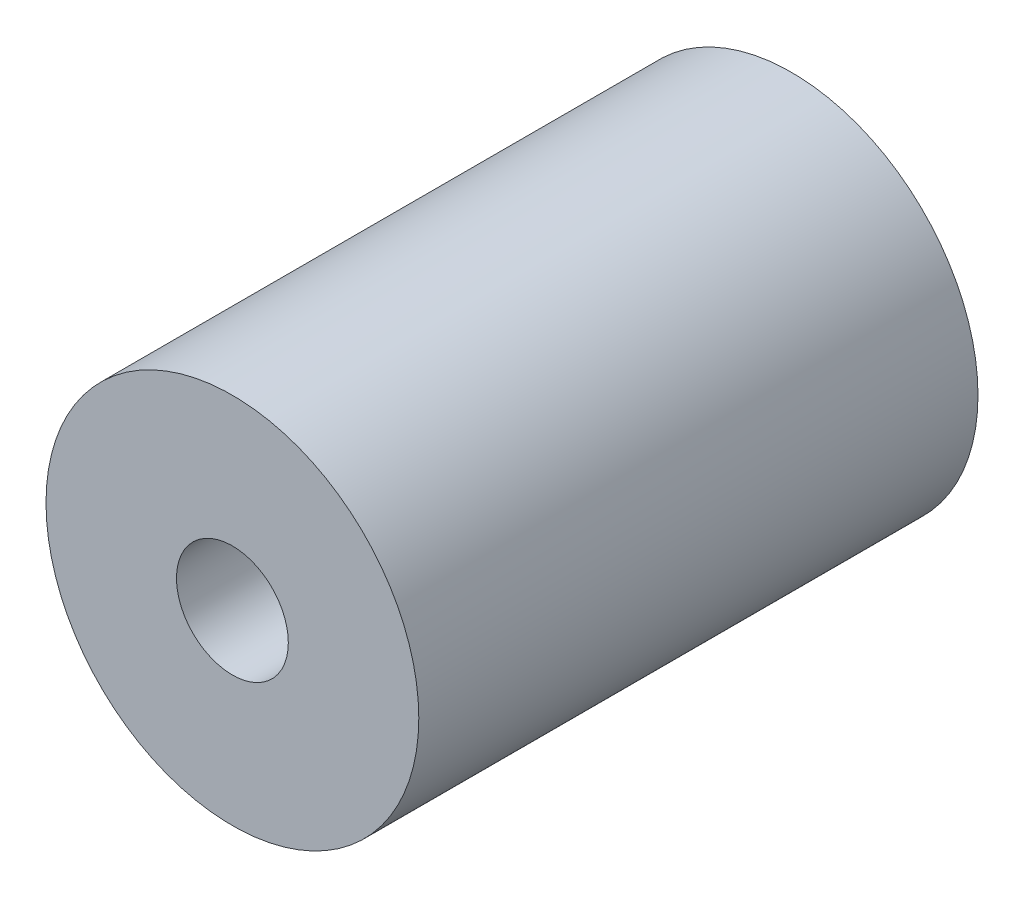
ISO-10303-21;
HEADER;
FILE_DESCRIPTION(('STEP AP214'),'2;1');
FILE_NAME('part.step','',(''),(''),'','','');
FILE_SCHEMA(('AUTOMOTIVE_DESIGN { 1 0 10303 214 1 1 1 1 }'));
ENDSEC;
DATA;
#1=APPLICATION_CONTEXT('core data for automotive mechanical design processes');
#2=APPLICATION_PROTOCOL_DEFINITION('international standard','automotive_design',2000,#1);
#3=PRODUCT_CONTEXT('',#1,'mechanical');
#4=PRODUCT('Part','Part','',(#3));
#5=PRODUCT_RELATED_PRODUCT_CATEGORY('part','',(#4));
#6=PRODUCT_DEFINITION_FORMATION('','',#4);
#7=PRODUCT_DEFINITION_CONTEXT('part definition',#1,'design');
#8=PRODUCT_DEFINITION('design','',#6,#7);
#9=PRODUCT_DEFINITION_SHAPE('','',#8);
#10=(LENGTH_UNIT() NAMED_UNIT(*) SI_UNIT(.MILLI.,.METRE.));
#11=(NAMED_UNIT(*) PLANE_ANGLE_UNIT() SI_UNIT($,.RADIAN.));
#12=(NAMED_UNIT(*) SI_UNIT($,.STERADIAN.) SOLID_ANGLE_UNIT());
#13=UNCERTAINTY_MEASURE_WITH_UNIT(LENGTH_MEASURE(1.E-05),#10,'distance_accuracy_value','');
#14=(GEOMETRIC_REPRESENTATION_CONTEXT(3) GLOBAL_UNCERTAINTY_ASSIGNED_CONTEXT((#13)) GLOBAL_UNIT_ASSIGNED_CONTEXT((#10,
#11,#12)) REPRESENTATION_CONTEXT('',''));
#15=CARTESIAN_POINT('',(0.,0.,0.));
#16=DIRECTION('',(0.,0.,1.));
#17=DIRECTION('',(1.,0.,0.));
#18=AXIS2_PLACEMENT_3D('',#15,#16,#17);
#19=CARTESIAN_POINT('',(0.,0.,15.));
#20=DIRECTION('',(0.,0.,-1.));
#21=DIRECTION('',(-1.,0.,0.));
#22=AXIS2_PLACEMENT_3D('',#19,#20,#21);
#23=CYLINDRICAL_SURFACE('',#22,5.);
#24=CARTESIAN_POINT('',(0.,0.,15.));
#25=DIRECTION('',(0.,0.,1.));
#26=DIRECTION('',(1.,0.,0.));
#27=AXIS2_PLACEMENT_3D('',#24,#25,#26);
#28=CIRCLE('',#27,5.);
#29=CARTESIAN_POINT('',(5.,0.,15.));
#30=VERTEX_POINT('',#29);
#31=EDGE_CURVE('E10',#30,#30,#28,.T.);
#32=ORIENTED_EDGE('',*,*,#31,.F.);
#33=EDGE_LOOP('',(#32));
#34=FACE_BOUND('',#33,.T.);
#35=CARTESIAN_POINT('',(0.,0.,0.));
#36=DIRECTION('',(0.,0.,1.));
#37=DIRECTION('',(1.,0.,0.));
#38=AXIS2_PLACEMENT_3D('',#35,#36,#37);
#39=CIRCLE('',#38,5.);
#40=CARTESIAN_POINT('',(5.,0.,0.));
#41=VERTEX_POINT('',#40);
#42=EDGE_CURVE('E40',#41,#41,#39,.T.);
#43=ORIENTED_EDGE('',*,*,#42,.T.);
#44=EDGE_LOOP('',(#43));
#45=FACE_BOUND('',#44,.T.);
#46=ADVANCED_FACE('F33',(#34,#45),#23,.T.);
#47=CARTESIAN_POINT('',(0.,0.,15.));
#48=DIRECTION('',(0.,0.,1.));
#49=DIRECTION('',(1.,0.,0.));
#50=AXIS2_PLACEMENT_3D('',#47,#48,#49);
#51=PLANE('',#50);
#52=CARTESIAN_POINT('',(0.,0.,15.));
#53=DIRECTION('',(0.,0.,1.));
#54=DIRECTION('',(1.,0.,0.));
#55=AXIS2_PLACEMENT_3D('',#52,#53,#54);
#56=CIRCLE('',#55,1.5);
#57=CARTESIAN_POINT('',(1.5,0.,15.));
#58=VERTEX_POINT('',#57);
#59=EDGE_CURVE('E46',#58,#58,#56,.T.);
#60=ORIENTED_EDGE('',*,*,#59,.F.);
#61=EDGE_LOOP('',(#60));
#62=FACE_BOUND('',#61,.T.);
#63=ORIENTED_EDGE('',*,*,#31,.T.);
#64=EDGE_LOOP('',(#63));
#65=FACE_BOUND('',#64,.T.);
#66=ADVANCED_FACE('F62',(#62,#65),#51,.T.);
#67=CARTESIAN_POINT('',(0.,0.,0.));
#68=DIRECTION('',(0.,0.,1.));
#69=DIRECTION('',(1.,0.,0.));
#70=AXIS2_PLACEMENT_3D('',#67,#68,#69);
#71=PLANE('',#70);
#72=CARTESIAN_POINT('',(0.,0.,0.));
#73=DIRECTION('',(0.,0.,1.));
#74=DIRECTION('',(1.,0.,0.));
#75=AXIS2_PLACEMENT_3D('',#72,#73,#74);
#76=CIRCLE('',#75,1.5);
#77=CARTESIAN_POINT('',(1.5,0.,0.));
#78=VERTEX_POINT('',#77);
#79=EDGE_CURVE('E36',#78,#78,#76,.T.);
#80=ORIENTED_EDGE('',*,*,#79,.T.);
#81=EDGE_LOOP('',(#80));
#82=FACE_BOUND('',#81,.T.);
#83=ORIENTED_EDGE('',*,*,#42,.F.);
#84=EDGE_LOOP('',(#83));
#85=FACE_BOUND('',#84,.T.);
#86=ADVANCED_FACE('F53',(#82,#85),#71,.F.);
#87=CARTESIAN_POINT('',(0.,0.,-5.));
#88=DIRECTION('',(0.,0.,1.));
#89=DIRECTION('',(1.,0.,0.));
#90=AXIS2_PLACEMENT_3D('',#87,#88,#89);
#91=CYLINDRICAL_SURFACE('',#90,1.5);
#92=ORIENTED_EDGE('',*,*,#59,.T.);
#93=EDGE_LOOP('',(#92));
#94=FACE_BOUND('',#93,.T.);
#95=ORIENTED_EDGE('',*,*,#79,.F.);
#96=EDGE_LOOP('',(#95));
#97=FACE_BOUND('',#96,.T.);
#98=ADVANCED_FACE('F56',(#94,#97),#91,.F.);
#99=CLOSED_SHELL('',(#46,#66,#86,#98));
#100=MANIFOLD_SOLID_BREP('B2',#99);
#101=ADVANCED_BREP_SHAPE_REPRESENTATION('',(#18,#100),#14);
#102=SHAPE_DEFINITION_REPRESENTATION(#9,#101);
ENDSEC;
END-ISO-10303-21;
